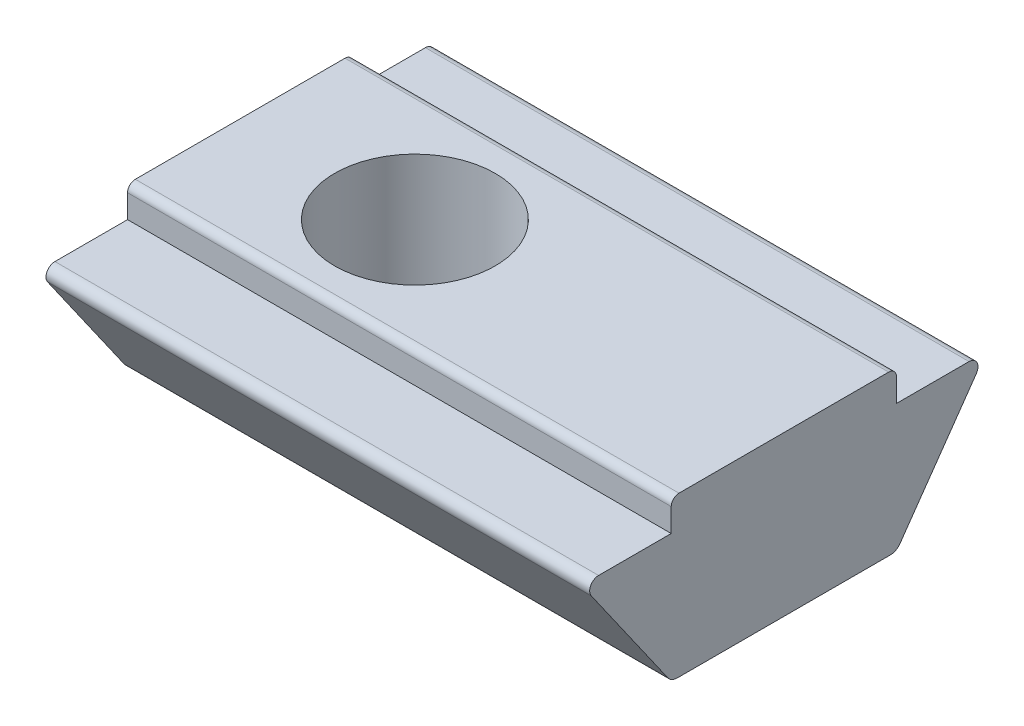
ISO-10303-21;
HEADER;
FILE_DESCRIPTION(('STEP AP214'),'2;1');
FILE_NAME('part.step','',(''),(''),'','','');
FILE_SCHEMA(('AUTOMOTIVE_DESIGN { 1 0 10303 214 1 1 1 1 }'));
ENDSEC;
DATA;
#1=APPLICATION_CONTEXT('core data for automotive mechanical design processes');
#2=APPLICATION_PROTOCOL_DEFINITION('international standard','automotive_design',2000,#1);
#3=PRODUCT_CONTEXT('',#1,'mechanical');
#4=PRODUCT('Part','Part','',(#3));
#5=PRODUCT_RELATED_PRODUCT_CATEGORY('part','',(#4));
#6=PRODUCT_DEFINITION_FORMATION('','',#4);
#7=PRODUCT_DEFINITION_CONTEXT('part definition',#1,'design');
#8=PRODUCT_DEFINITION('design','',#6,#7);
#9=PRODUCT_DEFINITION_SHAPE('','',#8);
#10=(LENGTH_UNIT() NAMED_UNIT(*) SI_UNIT(.MILLI.,.METRE.));
#11=(NAMED_UNIT(*) PLANE_ANGLE_UNIT() SI_UNIT($,.RADIAN.));
#12=(NAMED_UNIT(*) SI_UNIT($,.STERADIAN.) SOLID_ANGLE_UNIT());
#13=UNCERTAINTY_MEASURE_WITH_UNIT(LENGTH_MEASURE(1.E-05),#10,'distance_accuracy_value','');
#14=(GEOMETRIC_REPRESENTATION_CONTEXT(3) GLOBAL_UNCERTAINTY_ASSIGNED_CONTEXT((#13)) GLOBAL_UNIT_ASSIGNED_CONTEXT((#10,
#11,#12)) REPRESENTATION_CONTEXT('',''));
#15=CARTESIAN_POINT('',(0.,0.,0.));
#16=DIRECTION('',(0.,0.,1.));
#17=DIRECTION('',(1.,0.,0.));
#18=AXIS2_PLACEMENT_3D('',#15,#16,#17);
#19=CARTESIAN_POINT('',(6.,-3.9,0.));
#20=DIRECTION('',(0.,-1.,0.));
#21=DIRECTION('',(0.,0.,-1.));
#22=AXIS2_PLACEMENT_3D('',#19,#20,#21);
#23=PLANE('',#22);
#24=CARTESIAN_POINT('',(6.,-3.9,0.));
#25=DIRECTION('',(0.,1.,0.));
#26=DIRECTION('',(0.,0.,1.));
#27=AXIS2_PLACEMENT_3D('',#24,#25,#26);
#28=CIRCLE('',#27,2.1);
#29=CARTESIAN_POINT('',(6.,-3.9,2.1));
#30=VERTEX_POINT('',#29);
#31=EDGE_CURVE('E456',#30,#30,#28,.T.);
#32=ORIENTED_EDGE('',*,*,#31,.F.);
#33=EDGE_LOOP('',(#32));
#34=FACE_BOUND('',#33,.T.);
#35=CARTESIAN_POINT('',(6.,-3.9,0.));
#36=DIRECTION('',(0.,1.,0.));
#37=DIRECTION('',(0.,0.,1.));
#38=AXIS2_PLACEMENT_3D('',#35,#36,#37);
#39=CIRCLE('',#38,1.67032930884901);
#40=CARTESIAN_POINT('',(6.,-3.9,1.67032930884901));
#41=VERTEX_POINT('',#40);
#42=EDGE_CURVE('E454',#41,#41,#39,.T.);
#43=ORIENTED_EDGE('',*,*,#42,.T.);
#44=EDGE_LOOP('',(#43));
#45=FACE_BOUND('',#44,.T.);
#46=ADVANCED_FACE('F38',(#34,#45),#23,.T.);
#47=CARTESIAN_POINT('',(9.5,-4.1,2.9));
#48=DIRECTION('',(0.,1.,0.));
#49=DIRECTION('',(0.,0.,1.));
#50=AXIS2_PLACEMENT_3D('',#47,#48,#49);
#51=PLANE('',#50);
#52=CARTESIAN_POINT('',(0.,-4.1,0.));
#53=DIRECTION('',(0.,1.,0.));
#54=DIRECTION('',(0.,0.,1.));
#55=AXIS2_PLACEMENT_3D('',#52,#53,#54);
#56=CIRCLE('',#55,2.067);
#57=CARTESIAN_POINT('',(0.,-4.1,2.067));
#58=VERTEX_POINT('',#57);
#59=EDGE_CURVE('E42',#58,#58,#56,.T.);
#60=ORIENTED_EDGE('',*,*,#59,.T.);
#61=EDGE_LOOP('',(#60));
#62=FACE_BOUND('',#61,.T.);
#63=DIRECTION('',(0.,0.,-1.));
#64=VECTOR('',#63,1.);
#65=CARTESIAN_POINT('',(9.5,-4.1,2.9));
#66=LINE('',#65,#64);
#67=CARTESIAN_POINT('',(9.5,-4.1,2.74387955376189));
#68=VERTEX_POINT('',#67);
#69=CARTESIAN_POINT('',(9.5,-4.1,-2.74387955376189));
#70=VERTEX_POINT('',#69);
#71=EDGE_CURVE('E174',#68,#70,#66,.T.);
#72=ORIENTED_EDGE('',*,*,#71,.F.);
#73=DIRECTION('',(-1.,0.,0.));
#74=VECTOR('',#73,1.);
#75=CARTESIAN_POINT('',(9.5,-4.1,2.74387955376189));
#76=LINE('',#75,#74);
#77=CARTESIAN_POINT('',(-4.5,-4.1,2.74387955376189));
#78=VERTEX_POINT('',#77);
#79=EDGE_CURVE('E220',#68,#78,#76,.T.);
#80=ORIENTED_EDGE('',*,*,#79,.T.);
#81=DIRECTION('',(0.,0.,-1.));
#82=VECTOR('',#81,1.);
#83=CARTESIAN_POINT('',(-4.5,-4.1,2.9));
#84=LINE('',#83,#82);
#85=CARTESIAN_POINT('',(-4.5,-4.1,-2.74387955376189));
#86=VERTEX_POINT('',#85);
#87=EDGE_CURVE('E197',#78,#86,#84,.T.);
#88=ORIENTED_EDGE('',*,*,#87,.T.);
#89=DIRECTION('',(-1.,0.,0.));
#90=VECTOR('',#89,1.);
#91=CARTESIAN_POINT('',(9.5,-4.1,-2.74387955376189));
#92=LINE('',#91,#90);
#93=EDGE_CURVE('E160',#86,#70,#92,.F.);
#94=ORIENTED_EDGE('',*,*,#93,.T.);
#95=EDGE_LOOP('',(#72,#80,#88,#94));
#96=FACE_BOUND('',#95,.T.);
#97=CARTESIAN_POINT('',(6.,-4.1,0.));
#98=DIRECTION('',(0.,1.,0.));
#99=DIRECTION('',(0.,0.,1.));
#100=AXIS2_PLACEMENT_3D('',#97,#98,#99);
#101=CIRCLE('',#100,2.1);
#102=CARTESIAN_POINT('',(6.,-4.1,2.1));
#103=VERTEX_POINT('',#102);
#104=EDGE_CURVE('E187',#103,#103,#101,.T.);
#105=ORIENTED_EDGE('',*,*,#104,.T.);
#106=EDGE_LOOP('',(#105));
#107=FACE_BOUND('',#106,.T.);
#108=ADVANCED_FACE('F280',(#62,#96,#107),#51,.F.);
#109=CARTESIAN_POINT('',(9.5,-0.8,-2.9));
#110=DIRECTION('',(0.,0.,1.));
#111=DIRECTION('',(0.,-1.,0.));
#112=AXIS2_PLACEMENT_3D('',#109,#110,#111);
#113=PLANE('',#112);
#114=DIRECTION('',(0.,1.,0.));
#115=VECTOR('',#114,1.);
#116=CARTESIAN_POINT('',(-4.5,-0.8,-2.9));
#117=LINE('',#116,#115);
#118=CARTESIAN_POINT('',(-4.5,-0.8,-2.9));
#119=VERTEX_POINT('',#118);
#120=CARTESIAN_POINT('',(-4.5,-0.2,-2.9));
#121=VERTEX_POINT('',#120);
#122=EDGE_CURVE('E184',#119,#121,#117,.T.);
#123=ORIENTED_EDGE('',*,*,#122,.T.);
#124=DIRECTION('',(-1.,0.,0.));
#125=VECTOR('',#124,1.);
#126=CARTESIAN_POINT('',(9.5,-0.2,-2.9));
#127=LINE('',#126,#125);
#128=CARTESIAN_POINT('',(9.5,-0.2,-2.9));
#129=VERTEX_POINT('',#128);
#130=EDGE_CURVE('E11',#121,#129,#127,.F.);
#131=ORIENTED_EDGE('',*,*,#130,.T.);
#132=DIRECTION('',(0.,1.,0.));
#133=VECTOR('',#132,1.);
#134=CARTESIAN_POINT('',(9.5,-0.8,-2.9));
#135=LINE('',#134,#133);
#136=CARTESIAN_POINT('',(9.5,-0.8,-2.9));
#137=VERTEX_POINT('',#136);
#138=EDGE_CURVE('E206',#137,#129,#135,.T.);
#139=ORIENTED_EDGE('',*,*,#138,.F.);
#140=DIRECTION('',(-1.,0.,0.));
#141=VECTOR('',#140,1.);
#142=CARTESIAN_POINT('',(9.5,-0.8,-2.9));
#143=LINE('',#142,#141);
#144=EDGE_CURVE('E183',#137,#119,#143,.T.);
#145=ORIENTED_EDGE('',*,*,#144,.T.);
#146=EDGE_LOOP('',(#123,#131,#139,#145));
#147=FACE_BOUND('',#146,.T.);
#148=ADVANCED_FACE('F257',(#147),#113,.F.);
#149=CARTESIAN_POINT('',(9.5,0.,-2.9));
#150=DIRECTION('',(0.,-1.,0.));
#151=DIRECTION('',(0.,0.,-1.));
#152=AXIS2_PLACEMENT_3D('',#149,#150,#151);
#153=PLANE('',#152);
#154=CARTESIAN_POINT('',(0.,0.,0.));
#155=DIRECTION('',(0.,1.,0.));
#156=DIRECTION('',(0.,0.,1.));
#157=AXIS2_PLACEMENT_3D('',#154,#155,#156);
#158=CIRCLE('',#157,2.067);
#159=CARTESIAN_POINT('',(0.,0.,2.067));
#160=VERTEX_POINT('',#159);
#161=EDGE_CURVE('E451',#160,#160,#158,.T.);
#162=ORIENTED_EDGE('',*,*,#161,.F.);
#163=EDGE_LOOP('',(#162));
#164=FACE_BOUND('',#163,.T.);
#165=DIRECTION('',(0.,0.,1.));
#166=VECTOR('',#165,1.);
#167=CARTESIAN_POINT('',(-4.5,0.,-2.9));
#168=LINE('',#167,#166);
#169=CARTESIAN_POINT('',(-4.5,0.,-2.7));
#170=VERTEX_POINT('',#169);
#171=CARTESIAN_POINT('',(-4.5,0.,2.7));
#172=VERTEX_POINT('',#171);
#173=EDGE_CURVE('E186',#170,#172,#168,.T.);
#174=ORIENTED_EDGE('',*,*,#173,.T.);
#175=DIRECTION('',(-1.,0.,0.));
#176=VECTOR('',#175,1.);
#177=CARTESIAN_POINT('',(9.5,0.,2.7));
#178=LINE('',#177,#176);
#179=CARTESIAN_POINT('',(9.5,0.,2.7));
#180=VERTEX_POINT('',#179);
#181=EDGE_CURVE('E60',#172,#180,#178,.F.);
#182=ORIENTED_EDGE('',*,*,#181,.T.);
#183=DIRECTION('',(0.,0.,1.));
#184=VECTOR('',#183,1.);
#185=CARTESIAN_POINT('',(9.5,0.,-2.9));
#186=LINE('',#185,#184);
#187=CARTESIAN_POINT('',(9.5,0.,-2.7));
#188=VERTEX_POINT('',#187);
#189=EDGE_CURVE('E151',#188,#180,#186,.T.);
#190=ORIENTED_EDGE('',*,*,#189,.F.);
#191=DIRECTION('',(-1.,0.,0.));
#192=VECTOR('',#191,1.);
#193=CARTESIAN_POINT('',(9.5,0.,-2.7));
#194=LINE('',#193,#192);
#195=EDGE_CURVE('E242',#188,#170,#194,.T.);
#196=ORIENTED_EDGE('',*,*,#195,.T.);
#197=EDGE_LOOP('',(#174,#182,#190,#196));
#198=FACE_BOUND('',#197,.T.);
#199=ADVANCED_FACE('F251',(#164,#198),#153,.F.);
#200=CARTESIAN_POINT('',(9.5,0.,2.9));
#201=DIRECTION('',(0.,0.,-1.));
#202=DIRECTION('',(0.,1.,0.));
#203=AXIS2_PLACEMENT_3D('',#200,#201,#202);
#204=PLANE('',#203);
#205=DIRECTION('',(0.,-1.,0.));
#206=VECTOR('',#205,1.);
#207=CARTESIAN_POINT('',(9.5,0.,2.9));
#208=LINE('',#207,#206);
#209=CARTESIAN_POINT('',(9.5,-0.2,2.9));
#210=VERTEX_POINT('',#209);
#211=CARTESIAN_POINT('',(9.5,-0.8,2.9));
#212=VERTEX_POINT('',#211);
#213=EDGE_CURVE('E141',#210,#212,#208,.T.);
#214=ORIENTED_EDGE('',*,*,#213,.F.);
#215=DIRECTION('',(-1.,0.,0.));
#216=VECTOR('',#215,1.);
#217=CARTESIAN_POINT('',(9.5,-0.2,2.9));
#218=LINE('',#217,#216);
#219=CARTESIAN_POINT('',(-4.5,-0.2,2.9));
#220=VERTEX_POINT('',#219);
#221=EDGE_CURVE('E236',#210,#220,#218,.T.);
#222=ORIENTED_EDGE('',*,*,#221,.T.);
#223=DIRECTION('',(0.,-1.,0.));
#224=VECTOR('',#223,1.);
#225=CARTESIAN_POINT('',(-4.5,0.,2.9));
#226=LINE('',#225,#224);
#227=CARTESIAN_POINT('',(-4.5,-0.8,2.9));
#228=VERTEX_POINT('',#227);
#229=EDGE_CURVE('E157',#220,#228,#226,.T.);
#230=ORIENTED_EDGE('',*,*,#229,.T.);
#231=DIRECTION('',(-1.,0.,0.));
#232=VECTOR('',#231,1.);
#233=CARTESIAN_POINT('',(9.5,-0.8,2.9));
#234=LINE('',#233,#232);
#235=EDGE_CURVE('E154',#212,#228,#234,.T.);
#236=ORIENTED_EDGE('',*,*,#235,.F.);
#237=EDGE_LOOP('',(#214,#222,#230,#236));
#238=FACE_BOUND('',#237,.T.);
#239=ADVANCED_FACE('F155',(#238),#204,.F.);
#240=CARTESIAN_POINT('',(9.5,-0.8,2.9));
#241=DIRECTION('',(0.,-1.,0.));
#242=DIRECTION('',(0.,0.,-1.));
#243=AXIS2_PLACEMENT_3D('',#240,#241,#242);
#244=PLANE('',#243);
#245=DIRECTION('',(0.,0.,1.));
#246=VECTOR('',#245,1.);
#247=CARTESIAN_POINT('',(-4.5,-0.8,2.9));
#248=LINE('',#247,#246);
#249=CARTESIAN_POINT('',(-4.5,-0.8,4.77));
#250=VERTEX_POINT('',#249);
#251=EDGE_CURVE('E190',#228,#250,#248,.T.);
#252=ORIENTED_EDGE('',*,*,#251,.T.);
#253=DIRECTION('',(-1.,0.,0.));
#254=VECTOR('',#253,1.);
#255=CARTESIAN_POINT('',(9.5,-0.8,4.77));
#256=LINE('',#255,#254);
#257=CARTESIAN_POINT('',(9.5,-0.8,4.77));
#258=VERTEX_POINT('',#257);
#259=EDGE_CURVE('E161',#258,#250,#256,.T.);
#260=ORIENTED_EDGE('',*,*,#259,.F.);
#261=DIRECTION('',(0.,0.,1.));
#262=VECTOR('',#261,1.);
#263=CARTESIAN_POINT('',(9.5,-0.8,2.9));
#264=LINE('',#263,#262);
#265=EDGE_CURVE('E145',#212,#258,#264,.T.);
#266=ORIENTED_EDGE('',*,*,#265,.F.);
#267=ORIENTED_EDGE('',*,*,#235,.T.);
#268=EDGE_LOOP('',(#252,#260,#266,#267));
#269=FACE_BOUND('',#268,.T.);
#270=ADVANCED_FACE('F163',(#269),#244,.F.);
#271=CARTESIAN_POINT('',(9.5,-1.03,4.77));
#272=DIRECTION('',(-1.,0.,0.));
#273=DIRECTION('',(0.,0.,1.));
#274=AXIS2_PLACEMENT_3D('',#271,#272,#273);
#275=CYLINDRICAL_SURFACE('',#274,0.229999999999999);
#276=CARTESIAN_POINT('',(-4.5,-1.03,4.77));
#277=DIRECTION('',(1.,0.,0.));
#278=DIRECTION('',(0.,0.,1.));
#279=AXIS2_PLACEMENT_3D('',#276,#277,#278);
#280=CIRCLE('',#279,0.229999999999999);
#281=CARTESIAN_POINT('',(-4.5,-1.16197166363797,4.95837059217571));
#282=VERTEX_POINT('',#281);
#283=EDGE_CURVE('E192',#250,#282,#280,.T.);
#284=ORIENTED_EDGE('',*,*,#283,.T.);
#285=DIRECTION('',(-1.,0.,0.));
#286=VECTOR('',#285,1.);
#287=CARTESIAN_POINT('',(9.5,-1.16197166363797,4.95837059217571));
#288=LINE('',#287,#286);
#289=CARTESIAN_POINT('',(9.5,-1.16197166363797,4.95837059217571));
#290=VERTEX_POINT('',#289);
#291=EDGE_CURVE('E215',#290,#282,#288,.T.);
#292=ORIENTED_EDGE('',*,*,#291,.F.);
#293=CARTESIAN_POINT('',(9.5,-1.03,4.77));
#294=DIRECTION('',(1.,0.,0.));
#295=DIRECTION('',(0.,0.,1.));
#296=AXIS2_PLACEMENT_3D('',#293,#294,#295);
#297=CIRCLE('',#296,0.229999999999999);
#298=EDGE_CURVE('E166',#258,#290,#297,.T.);
#299=ORIENTED_EDGE('',*,*,#298,.F.);
#300=ORIENTED_EDGE('',*,*,#259,.T.);
#301=EDGE_LOOP('',(#284,#292,#299,#300));
#302=FACE_BOUND('',#301,.T.);
#303=ADVANCED_FACE('F294',(#302),#275,.T.);
#304=CARTESIAN_POINT('',(9.5,-1.16197166363797,4.95837059217571));
#305=DIRECTION('',(0.,0.573789841904221,-0.819002574676984));
#306=DIRECTION('',(0.,0.819002574676984,0.573789841904221));
#307=AXIS2_PLACEMENT_3D('',#304,#305,#306);
#308=PLANE('',#307);
#309=DIRECTION('',(0.,-0.819002574676984,-0.573789841904221));
#310=VECTOR('',#309,1.);
#311=CARTESIAN_POINT('',(-4.5,-1.16197166363797,4.95837059217571));
#312=LINE('',#311,#310);
#313=CARTESIAN_POINT('',(-4.5,-3.97213695257127,2.98958032616498));
#314=VERTEX_POINT('',#313);
#315=EDGE_CURVE('E194',#282,#314,#312,.T.);
#316=ORIENTED_EDGE('',*,*,#315,.T.);
#317=DIRECTION('',(-1.,0.,0.));
#318=VECTOR('',#317,1.);
#319=CARTESIAN_POINT('',(9.5,-3.97213695257127,2.98958032616498));
#320=LINE('',#319,#318);
#321=CARTESIAN_POINT('',(9.5,-3.97213695257127,2.98958032616498));
#322=VERTEX_POINT('',#321);
#323=EDGE_CURVE('E227',#314,#322,#320,.F.);
#324=ORIENTED_EDGE('',*,*,#323,.T.);
#325=DIRECTION('',(0.,-0.819002574676984,-0.573789841904221));
#326=VECTOR('',#325,1.);
#327=CARTESIAN_POINT('',(9.5,-1.16197166363797,4.95837059217571));
#328=LINE('',#327,#326);
#329=EDGE_CURVE('E168',#290,#322,#328,.T.);
#330=ORIENTED_EDGE('',*,*,#329,.F.);
#331=ORIENTED_EDGE('',*,*,#291,.T.);
#332=EDGE_LOOP('',(#316,#324,#330,#331));
#333=FACE_BOUND('',#332,.T.);
#334=ADVANCED_FACE('F290',(#333),#308,.F.);
#335=CARTESIAN_POINT('',(9.5,-4.1,-2.9));
#336=DIRECTION('',(0.,0.573789841904222,0.819002574676984));
#337=DIRECTION('',(0.,-0.819002574676984,0.573789841904222));
#338=AXIS2_PLACEMENT_3D('',#335,#336,#337);
#339=PLANE('',#338);
#340=DIRECTION('',(0.,0.819002574676984,-0.573789841904222));
#341=VECTOR('',#340,1.);
#342=CARTESIAN_POINT('',(9.5,-4.1,-2.9));
#343=LINE('',#342,#341);
#344=CARTESIAN_POINT('',(9.5,-3.97213695257127,-2.98958032616498));
#345=VERTEX_POINT('',#344);
#346=CARTESIAN_POINT('',(9.5,-1.16197166363797,-4.95837059217571));
#347=VERTEX_POINT('',#346);
#348=EDGE_CURVE('E177',#345,#347,#343,.T.);
#349=ORIENTED_EDGE('',*,*,#348,.F.);
#350=DIRECTION('',(-1.,0.,0.));
#351=VECTOR('',#350,1.);
#352=CARTESIAN_POINT('',(9.5,-3.97213695257127,-2.98958032616498));
#353=LINE('',#352,#351);
#354=CARTESIAN_POINT('',(-4.5,-3.97213695257127,-2.98958032616498));
#355=VERTEX_POINT('',#354);
#356=EDGE_CURVE('E233',#345,#355,#353,.T.);
#357=ORIENTED_EDGE('',*,*,#356,.T.);
#358=DIRECTION('',(0.,0.819002574676984,-0.573789841904222));
#359=VECTOR('',#358,1.);
#360=CARTESIAN_POINT('',(-4.5,-4.1,-2.9));
#361=LINE('',#360,#359);
#362=CARTESIAN_POINT('',(-4.5,-1.16197166363797,-4.95837059217571));
#363=VERTEX_POINT('',#362);
#364=EDGE_CURVE('E200',#355,#363,#361,.T.);
#365=ORIENTED_EDGE('',*,*,#364,.T.);
#366=DIRECTION('',(-1.,0.,0.));
#367=VECTOR('',#366,1.);
#368=CARTESIAN_POINT('',(9.5,-1.16197166363797,-4.95837059217571));
#369=LINE('',#368,#367);
#370=EDGE_CURVE('E212',#347,#363,#369,.T.);
#371=ORIENTED_EDGE('',*,*,#370,.F.);
#372=EDGE_LOOP('',(#349,#357,#365,#371));
#373=FACE_BOUND('',#372,.T.);
#374=ADVANCED_FACE('F271',(#373),#339,.F.);
#375=CARTESIAN_POINT('',(9.5,-1.03,-4.77));
#376=DIRECTION('',(-1.,0.,0.));
#377=DIRECTION('',(0.,0.,1.));
#378=AXIS2_PLACEMENT_3D('',#375,#376,#377);
#379=CYLINDRICAL_SURFACE('',#378,0.23);
#380=CARTESIAN_POINT('',(-4.5,-1.03,-4.77));
#381=DIRECTION('',(1.,0.,0.));
#382=DIRECTION('',(0.,0.,-1.));
#383=AXIS2_PLACEMENT_3D('',#380,#381,#382);
#384=CIRCLE('',#383,0.23);
#385=CARTESIAN_POINT('',(-4.5,-0.799999999999999,-4.77));
#386=VERTEX_POINT('',#385);
#387=EDGE_CURVE('E202',#363,#386,#384,.T.);
#388=ORIENTED_EDGE('',*,*,#387,.T.);
#389=DIRECTION('',(-1.,0.,0.));
#390=VECTOR('',#389,1.);
#391=CARTESIAN_POINT('',(9.5,-0.799999999999999,-4.77));
#392=LINE('',#391,#390);
#393=CARTESIAN_POINT('',(9.5,-0.799999999999999,-4.77));
#394=VERTEX_POINT('',#393);
#395=EDGE_CURVE('E209',#394,#386,#392,.T.);
#396=ORIENTED_EDGE('',*,*,#395,.F.);
#397=CARTESIAN_POINT('',(9.5,-1.03,-4.77));
#398=DIRECTION('',(1.,0.,0.));
#399=DIRECTION('',(0.,0.,-1.));
#400=AXIS2_PLACEMENT_3D('',#397,#398,#399);
#401=CIRCLE('',#400,0.23);
#402=EDGE_CURVE('E179',#347,#394,#401,.T.);
#403=ORIENTED_EDGE('',*,*,#402,.F.);
#404=ORIENTED_EDGE('',*,*,#370,.T.);
#405=EDGE_LOOP('',(#388,#396,#403,#404));
#406=FACE_BOUND('',#405,.T.);
#407=ADVANCED_FACE('F266',(#406),#379,.T.);
#408=CARTESIAN_POINT('',(9.5,-0.799999999999999,-4.77));
#409=DIRECTION('',(0.,-1.,0.));
#410=DIRECTION('',(0.,0.,-1.));
#411=AXIS2_PLACEMENT_3D('',#408,#409,#410);
#412=PLANE('',#411);
#413=DIRECTION('',(0.,0.,1.));
#414=VECTOR('',#413,1.);
#415=CARTESIAN_POINT('',(-4.5,-0.799999999999999,-4.77));
#416=LINE('',#415,#414);
#417=EDGE_CURVE('E204',#386,#119,#416,.T.);
#418=ORIENTED_EDGE('',*,*,#417,.T.);
#419=ORIENTED_EDGE('',*,*,#144,.F.);
#420=DIRECTION('',(0.,0.,1.));
#421=VECTOR('',#420,1.);
#422=CARTESIAN_POINT('',(9.5,-0.799999999999999,-4.77));
#423=LINE('',#422,#421);
#424=EDGE_CURVE('E181',#394,#137,#423,.T.);
#425=ORIENTED_EDGE('',*,*,#424,.F.);
#426=ORIENTED_EDGE('',*,*,#395,.T.);
#427=EDGE_LOOP('',(#418,#419,#425,#426));
#428=FACE_BOUND('',#427,.T.);
#429=ADVANCED_FACE('F261',(#428),#412,.F.);
#430=CARTESIAN_POINT('',(9.5,-1.03,4.77));
#431=DIRECTION('',(-1.,0.,0.));
#432=DIRECTION('',(0.,0.,1.));
#433=AXIS2_PLACEMENT_3D('',#430,#431,#432);
#434=PLANE('',#433);
#435=ORIENTED_EDGE('',*,*,#189,.T.);
#436=CARTESIAN_POINT('',(9.5,-0.2,2.7));
#437=DIRECTION('',(-1.,0.,0.));
#438=DIRECTION('',(0.,0.,1.));
#439=AXIS2_PLACEMENT_3D('',#436,#437,#438);
#440=CIRCLE('',#439,0.2);
#441=EDGE_CURVE('E47',#180,#210,#440,.F.);
#442=ORIENTED_EDGE('',*,*,#441,.T.);
#443=ORIENTED_EDGE('',*,*,#213,.T.);
#444=ORIENTED_EDGE('',*,*,#265,.T.);
#445=ORIENTED_EDGE('',*,*,#298,.T.);
#446=ORIENTED_EDGE('',*,*,#329,.T.);
#447=CARTESIAN_POINT('',(9.5,-3.8,2.74387955376189));
#448=DIRECTION('',(-1.,0.,0.));
#449=DIRECTION('',(0.,0.,1.));
#450=AXIS2_PLACEMENT_3D('',#447,#448,#449);
#451=CIRCLE('',#450,0.3);
#452=EDGE_CURVE('E231',#322,#68,#451,.F.);
#453=ORIENTED_EDGE('',*,*,#452,.T.);
#454=ORIENTED_EDGE('',*,*,#71,.T.);
#455=CARTESIAN_POINT('',(9.5,-3.8,-2.74387955376189));
#456=DIRECTION('',(-1.,0.,0.));
#457=DIRECTION('',(0.,0.,1.));
#458=AXIS2_PLACEMENT_3D('',#455,#456,#457);
#459=CIRCLE('',#458,0.3);
#460=EDGE_CURVE('E229',#70,#345,#459,.F.);
#461=ORIENTED_EDGE('',*,*,#460,.T.);
#462=ORIENTED_EDGE('',*,*,#348,.T.);
#463=ORIENTED_EDGE('',*,*,#402,.T.);
#464=ORIENTED_EDGE('',*,*,#424,.T.);
#465=ORIENTED_EDGE('',*,*,#138,.T.);
#466=CARTESIAN_POINT('',(9.5,-0.2,-2.7));
#467=DIRECTION('',(-1.,0.,0.));
#468=DIRECTION('',(0.,0.,1.));
#469=AXIS2_PLACEMENT_3D('',#466,#467,#468);
#470=CIRCLE('',#469,0.2);
#471=EDGE_CURVE('E246',#129,#188,#470,.F.);
#472=ORIENTED_EDGE('',*,*,#471,.T.);
#473=EDGE_LOOP('',(#435,#442,#443,#444,#445,#446,#453,#454,#461,#462,#463,#464,#465,#472));
#474=FACE_BOUND('',#473,.T.);
#475=ADVANCED_FACE('F143',(#474),#434,.F.);
#476=CARTESIAN_POINT('',(-4.5,-1.03,4.77));
#477=DIRECTION('',(-1.,0.,0.));
#478=DIRECTION('',(0.,0.,1.));
#479=AXIS2_PLACEMENT_3D('',#476,#477,#478);
#480=PLANE('',#479);
#481=ORIENTED_EDGE('',*,*,#229,.F.);
#482=CARTESIAN_POINT('',(-4.5,-0.2,2.7));
#483=DIRECTION('',(-1.,0.,0.));
#484=DIRECTION('',(0.,0.,1.));
#485=AXIS2_PLACEMENT_3D('',#482,#483,#484);
#486=CIRCLE('',#485,0.2);
#487=EDGE_CURVE('E240',#220,#172,#486,.T.);
#488=ORIENTED_EDGE('',*,*,#487,.T.);
#489=ORIENTED_EDGE('',*,*,#173,.F.);
#490=CARTESIAN_POINT('',(-4.5,-0.2,-2.7));
#491=DIRECTION('',(-1.,0.,0.));
#492=DIRECTION('',(0.,0.,1.));
#493=AXIS2_PLACEMENT_3D('',#490,#491,#492);
#494=CIRCLE('',#493,0.2);
#495=EDGE_CURVE('E238',#170,#121,#494,.T.);
#496=ORIENTED_EDGE('',*,*,#495,.T.);
#497=ORIENTED_EDGE('',*,*,#122,.F.);
#498=ORIENTED_EDGE('',*,*,#417,.F.);
#499=ORIENTED_EDGE('',*,*,#387,.F.);
#500=ORIENTED_EDGE('',*,*,#364,.F.);
#501=CARTESIAN_POINT('',(-4.5,-3.8,-2.74387955376189));
#502=DIRECTION('',(-1.,0.,0.));
#503=DIRECTION('',(0.,0.,1.));
#504=AXIS2_PLACEMENT_3D('',#501,#502,#503);
#505=CIRCLE('',#504,0.3);
#506=EDGE_CURVE('E223',#355,#86,#505,.T.);
#507=ORIENTED_EDGE('',*,*,#506,.T.);
#508=ORIENTED_EDGE('',*,*,#87,.F.);
#509=CARTESIAN_POINT('',(-4.5,-3.8,2.74387955376189));
#510=DIRECTION('',(-1.,0.,0.));
#511=DIRECTION('',(0.,0.,1.));
#512=AXIS2_PLACEMENT_3D('',#509,#510,#511);
#513=CIRCLE('',#512,0.3);
#514=EDGE_CURVE('E225',#78,#314,#513,.T.);
#515=ORIENTED_EDGE('',*,*,#514,.T.);
#516=ORIENTED_EDGE('',*,*,#315,.F.);
#517=ORIENTED_EDGE('',*,*,#283,.F.);
#518=ORIENTED_EDGE('',*,*,#251,.F.);
#519=EDGE_LOOP('',(#481,#488,#489,#496,#497,#498,#499,#500,#507,#508,#515,#516,#517,#518));
#520=FACE_BOUND('',#519,.T.);
#521=ADVANCED_FACE('F255',(#520),#480,.T.);
#522=CARTESIAN_POINT('',(9.5,-3.8,2.74387955376189));
#523=DIRECTION('',(-1.,0.,0.));
#524=DIRECTION('',(0.,0.,1.));
#525=AXIS2_PLACEMENT_3D('',#522,#523,#524);
#526=CYLINDRICAL_SURFACE('',#525,0.3);
#527=ORIENTED_EDGE('',*,*,#452,.F.);
#528=ORIENTED_EDGE('',*,*,#323,.F.);
#529=ORIENTED_EDGE('',*,*,#514,.F.);
#530=ORIENTED_EDGE('',*,*,#79,.F.);
#531=EDGE_LOOP('',(#527,#528,#529,#530));
#532=FACE_BOUND('',#531,.T.);
#533=ADVANCED_FACE('F285',(#532),#526,.T.);
#534=CARTESIAN_POINT('',(9.5,-3.8,-2.74387955376189));
#535=DIRECTION('',(-1.,0.,0.));
#536=DIRECTION('',(0.,0.,1.));
#537=AXIS2_PLACEMENT_3D('',#534,#535,#536);
#538=CYLINDRICAL_SURFACE('',#537,0.3);
#539=ORIENTED_EDGE('',*,*,#460,.F.);
#540=ORIENTED_EDGE('',*,*,#93,.F.);
#541=ORIENTED_EDGE('',*,*,#506,.F.);
#542=ORIENTED_EDGE('',*,*,#356,.F.);
#543=EDGE_LOOP('',(#539,#540,#541,#542));
#544=FACE_BOUND('',#543,.T.);
#545=ADVANCED_FACE('F275',(#544),#538,.T.);
#546=CARTESIAN_POINT('',(9.5,-0.2,2.7));
#547=DIRECTION('',(-1.,0.,0.));
#548=DIRECTION('',(0.,0.,1.));
#549=AXIS2_PLACEMENT_3D('',#546,#547,#548);
#550=CYLINDRICAL_SURFACE('',#549,0.2);
#551=ORIENTED_EDGE('',*,*,#441,.F.);
#552=ORIENTED_EDGE('',*,*,#181,.F.);
#553=ORIENTED_EDGE('',*,*,#487,.F.);
#554=ORIENTED_EDGE('',*,*,#221,.F.);
#555=EDGE_LOOP('',(#551,#552,#553,#554));
#556=FACE_BOUND('',#555,.T.);
#557=ADVANCED_FACE('F296',(#556),#550,.T.);
#558=CARTESIAN_POINT('',(9.5,-0.2,-2.7));
#559=DIRECTION('',(-1.,0.,0.));
#560=DIRECTION('',(0.,0.,1.));
#561=AXIS2_PLACEMENT_3D('',#558,#559,#560);
#562=CYLINDRICAL_SURFACE('',#561,0.2);
#563=ORIENTED_EDGE('',*,*,#471,.F.);
#564=ORIENTED_EDGE('',*,*,#130,.F.);
#565=ORIENTED_EDGE('',*,*,#495,.F.);
#566=ORIENTED_EDGE('',*,*,#195,.F.);
#567=EDGE_LOOP('',(#563,#564,#565,#566));
#568=FACE_BOUND('',#567,.T.);
#569=ADVANCED_FACE('F40',(#568),#562,.T.);
#570=CARTESIAN_POINT('',(6.,1.66554857329047,0.));
#571=DIRECTION('',(0.,1.,0.));
#572=DIRECTION('',(0.,0.,1.));
#573=AXIS2_PLACEMENT_3D('',#570,#571,#572);
#574=CYLINDRICAL_SURFACE('',#573,2.1);
#575=ORIENTED_EDGE('',*,*,#31,.T.);
#576=EDGE_LOOP('',(#575));
#577=FACE_BOUND('',#576,.T.);
#578=ORIENTED_EDGE('',*,*,#104,.F.);
#579=EDGE_LOOP('',(#578));
#580=FACE_BOUND('',#579,.T.);
#581=ADVANCED_FACE('F302',(#577,#580),#574,.F.);
#582=CARTESIAN_POINT('',(6.,-2.8,0.));
#583=DIRECTION('',(0.,1.,0.));
#584=DIRECTION('',(0.,0.,1.));
#585=AXIS2_PLACEMENT_3D('',#582,#583,#584);
#586=SPHERICAL_SURFACE('',#585,2.);
#587=ORIENTED_EDGE('',*,*,#42,.F.);
#588=EDGE_LOOP('',(#587));
#589=FACE_BOUND('',#588,.T.);
#590=ADVANCED_FACE('F316',(#589),#586,.T.);
#591=CARTESIAN_POINT('',(0.,0.,0.));
#592=DIRECTION('',(0.,1.,0.));
#593=DIRECTION('',(0.,0.,1.));
#594=AXIS2_PLACEMENT_3D('',#591,#592,#593);
#595=CYLINDRICAL_SURFACE('',#594,2.067);
#596=ORIENTED_EDGE('',*,*,#161,.T.);
#597=EDGE_LOOP('',(#596));
#598=FACE_BOUND('',#597,.T.);
#599=ORIENTED_EDGE('',*,*,#59,.F.);
#600=EDGE_LOOP('',(#599));
#601=FACE_BOUND('',#600,.T.);
#602=ADVANCED_FACE('F409',(#598,#601),#595,.F.);
#603=CLOSED_SHELL('',(#46,#108,#148,#199,#239,#270,#303,#334,#374,#407,#429,#475,#521,#533,#545,
#557,#569,#581,#590,#602));
#604=MANIFOLD_SOLID_BREP('B2',#603);
#605=ADVANCED_BREP_SHAPE_REPRESENTATION('',(#18,#604),#14);
#606=SHAPE_DEFINITION_REPRESENTATION(#9,#605);
ENDSEC;
END-ISO-10303-21;
